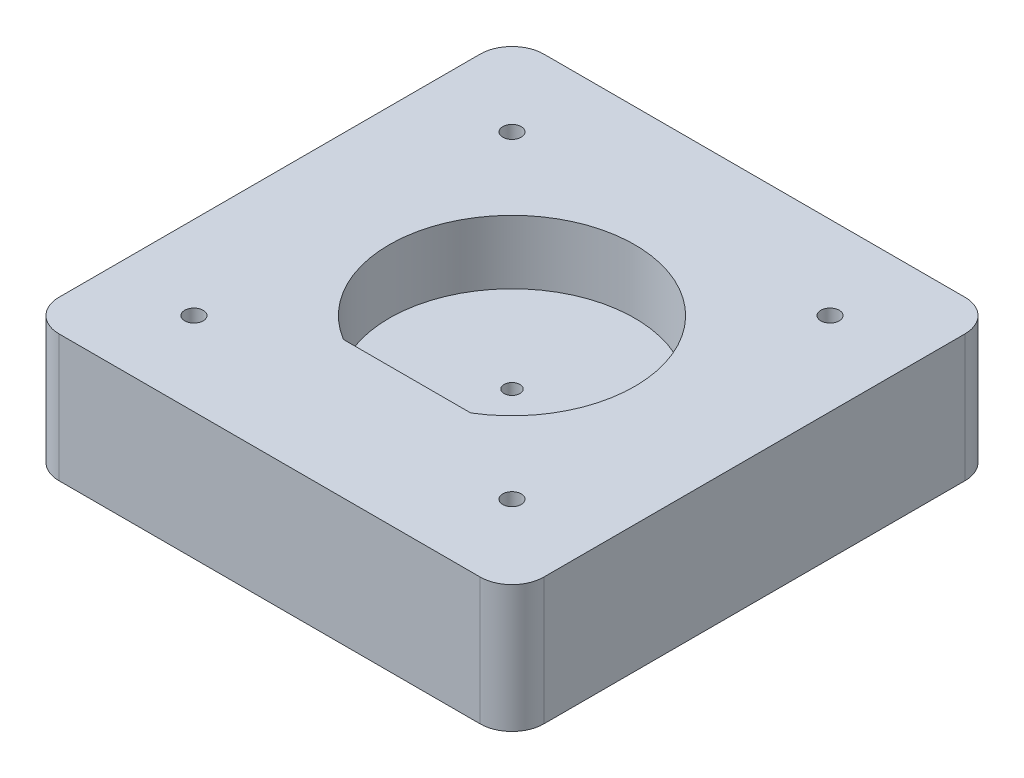
ISO-10303-21;
HEADER;
FILE_DESCRIPTION(('STEP AP214'),'2;1');
FILE_NAME('part.step','',(''),(''),'','','');
FILE_SCHEMA(('AUTOMOTIVE_DESIGN { 1 0 10303 214 1 1 1 1 }'));
ENDSEC;
DATA;
#1=APPLICATION_CONTEXT('core data for automotive mechanical design processes');
#2=APPLICATION_PROTOCOL_DEFINITION('international standard','automotive_design',2000,#1);
#3=PRODUCT_CONTEXT('',#1,'mechanical');
#4=PRODUCT('Part','Part','',(#3));
#5=PRODUCT_RELATED_PRODUCT_CATEGORY('part','',(#4));
#6=PRODUCT_DEFINITION_FORMATION('','',#4);
#7=PRODUCT_DEFINITION_CONTEXT('part definition',#1,'design');
#8=PRODUCT_DEFINITION('design','',#6,#7);
#9=PRODUCT_DEFINITION_SHAPE('','',#8);
#10=(LENGTH_UNIT() NAMED_UNIT(*) SI_UNIT(.MILLI.,.METRE.));
#11=(NAMED_UNIT(*) PLANE_ANGLE_UNIT() SI_UNIT($,.RADIAN.));
#12=(NAMED_UNIT(*) SI_UNIT($,.STERADIAN.) SOLID_ANGLE_UNIT());
#13=UNCERTAINTY_MEASURE_WITH_UNIT(LENGTH_MEASURE(1.E-05),#10,'distance_accuracy_value','');
#14=(GEOMETRIC_REPRESENTATION_CONTEXT(3) GLOBAL_UNCERTAINTY_ASSIGNED_CONTEXT((#13)) GLOBAL_UNIT_ASSIGNED_CONTEXT((#10,
#11,#12)) REPRESENTATION_CONTEXT('',''));
#15=CARTESIAN_POINT('',(0.,0.,0.));
#16=DIRECTION('',(0.,0.,1.));
#17=DIRECTION('',(1.,0.,0.));
#18=AXIS2_PLACEMENT_3D('',#15,#16,#17);
#19=CARTESIAN_POINT('',(38.1,20.,38.1));
#20=DIRECTION('',(-1.,0.,0.));
#21=DIRECTION('',(0.,0.,1.));
#22=AXIS2_PLACEMENT_3D('',#19,#20,#21);
#23=PLANE('',#22);
#24=DIRECTION('',(0.,0.,-1.));
#25=VECTOR('',#24,1.);
#26=CARTESIAN_POINT('',(38.1,0.,38.1));
#27=LINE('',#26,#25);
#28=CARTESIAN_POINT('',(38.1,0.,33.1));
#29=VERTEX_POINT('',#28);
#30=CARTESIAN_POINT('',(38.1,0.,-33.1));
#31=VERTEX_POINT('',#30);
#32=EDGE_CURVE('E139',#29,#31,#27,.T.);
#33=ORIENTED_EDGE('',*,*,#32,.T.);
#34=DIRECTION('',(0.,-1.,0.));
#35=VECTOR('',#34,1.);
#36=CARTESIAN_POINT('',(38.1,20.,-33.1));
#37=LINE('',#36,#35);
#38=CARTESIAN_POINT('',(38.1,20.,-33.1));
#39=VERTEX_POINT('',#38);
#40=EDGE_CURVE('E177',#31,#39,#37,.F.);
#41=ORIENTED_EDGE('',*,*,#40,.T.);
#42=DIRECTION('',(0.,0.,-1.));
#43=VECTOR('',#42,1.);
#44=CARTESIAN_POINT('',(38.1,20.,38.1));
#45=LINE('',#44,#43);
#46=CARTESIAN_POINT('',(38.1,20.,33.1));
#47=VERTEX_POINT('',#46);
#48=EDGE_CURVE('E141',#47,#39,#45,.T.);
#49=ORIENTED_EDGE('',*,*,#48,.F.);
#50=DIRECTION('',(0.,-1.,0.));
#51=VECTOR('',#50,1.);
#52=CARTESIAN_POINT('',(38.1,20.,33.1));
#53=LINE('',#52,#51);
#54=EDGE_CURVE('E174',#47,#29,#53,.T.);
#55=ORIENTED_EDGE('',*,*,#54,.T.);
#56=EDGE_LOOP('',(#33,#41,#49,#55));
#57=FACE_BOUND('',#56,.T.);
#58=ADVANCED_FACE('F36',(#57),#23,.F.);
#59=CARTESIAN_POINT('',(-38.1,20.,-38.1));
#60=DIRECTION('',(0.,0.,1.));
#61=DIRECTION('',(1.,0.,0.));
#62=AXIS2_PLACEMENT_3D('',#59,#60,#61);
#63=PLANE('',#62);
#64=DIRECTION('',(-1.,0.,0.));
#65=VECTOR('',#64,1.);
#66=CARTESIAN_POINT('',(-38.1,20.,-38.1));
#67=LINE('',#66,#65);
#68=CARTESIAN_POINT('',(33.1,20.,-38.1));
#69=VERTEX_POINT('',#68);
#70=CARTESIAN_POINT('',(-33.1,20.,-38.1));
#71=VERTEX_POINT('',#70);
#72=EDGE_CURVE('E144',#69,#71,#67,.T.);
#73=ORIENTED_EDGE('',*,*,#72,.F.);
#74=DIRECTION('',(0.,-1.,0.));
#75=VECTOR('',#74,1.);
#76=CARTESIAN_POINT('',(33.1,20.,-38.1));
#77=LINE('',#76,#75);
#78=CARTESIAN_POINT('',(33.1,0.,-38.1));
#79=VERTEX_POINT('',#78);
#80=EDGE_CURVE('E163',#69,#79,#77,.T.);
#81=ORIENTED_EDGE('',*,*,#80,.T.);
#82=DIRECTION('',(-1.,0.,0.));
#83=VECTOR('',#82,1.);
#84=CARTESIAN_POINT('',(-38.1,0.,-38.1));
#85=LINE('',#84,#83);
#86=CARTESIAN_POINT('',(-33.1,0.,-38.1));
#87=VERTEX_POINT('',#86);
#88=EDGE_CURVE('E155',#79,#87,#85,.T.);
#89=ORIENTED_EDGE('',*,*,#88,.T.);
#90=DIRECTION('',(0.,-1.,0.));
#91=VECTOR('',#90,1.);
#92=CARTESIAN_POINT('',(-33.1,20.,-38.1));
#93=LINE('',#92,#91);
#94=EDGE_CURVE('E152',#87,#71,#93,.F.);
#95=ORIENTED_EDGE('',*,*,#94,.T.);
#96=EDGE_LOOP('',(#73,#81,#89,#95));
#97=FACE_BOUND('',#96,.T.);
#98=ADVANCED_FACE('F220',(#97),#63,.F.);
#99=CARTESIAN_POINT('',(-38.1,20.,38.1));
#100=DIRECTION('',(1.,0.,0.));
#101=DIRECTION('',(0.,0.,-1.));
#102=AXIS2_PLACEMENT_3D('',#99,#100,#101);
#103=PLANE('',#102);
#104=DIRECTION('',(0.,0.,1.));
#105=VECTOR('',#104,1.);
#106=CARTESIAN_POINT('',(-38.1,20.,38.1));
#107=LINE('',#106,#105);
#108=CARTESIAN_POINT('',(-38.1,20.,-33.1));
#109=VERTEX_POINT('',#108);
#110=CARTESIAN_POINT('',(-38.1,20.,33.1));
#111=VERTEX_POINT('',#110);
#112=EDGE_CURVE('E148',#109,#111,#107,.T.);
#113=ORIENTED_EDGE('',*,*,#112,.F.);
#114=DIRECTION('',(0.,-1.,0.));
#115=VECTOR('',#114,1.);
#116=CARTESIAN_POINT('',(-38.1,20.,-33.1));
#117=LINE('',#116,#115);
#118=CARTESIAN_POINT('',(-38.1,0.,-33.1));
#119=VERTEX_POINT('',#118);
#120=EDGE_CURVE('E188',#109,#119,#117,.T.);
#121=ORIENTED_EDGE('',*,*,#120,.T.);
#122=DIRECTION('',(0.,0.,1.));
#123=VECTOR('',#122,1.);
#124=CARTESIAN_POINT('',(-38.1,0.,38.1));
#125=LINE('',#124,#123);
#126=CARTESIAN_POINT('',(-38.1,0.,33.1));
#127=VERTEX_POINT('',#126);
#128=EDGE_CURVE('E158',#119,#127,#125,.T.);
#129=ORIENTED_EDGE('',*,*,#128,.T.);
#130=DIRECTION('',(0.,-1.,0.));
#131=VECTOR('',#130,1.);
#132=CARTESIAN_POINT('',(-38.1,20.,33.1));
#133=LINE('',#132,#131);
#134=EDGE_CURVE('E186',#127,#111,#133,.F.);
#135=ORIENTED_EDGE('',*,*,#134,.T.);
#136=EDGE_LOOP('',(#113,#121,#129,#135));
#137=FACE_BOUND('',#136,.T.);
#138=ADVANCED_FACE('F194',(#137),#103,.F.);
#139=CARTESIAN_POINT('',(-38.1,20.,38.1));
#140=DIRECTION('',(0.,0.,-1.));
#141=DIRECTION('',(-1.,0.,0.));
#142=AXIS2_PLACEMENT_3D('',#139,#140,#141);
#143=PLANE('',#142);
#144=DIRECTION('',(1.,0.,0.));
#145=VECTOR('',#144,1.);
#146=CARTESIAN_POINT('',(-38.1,20.,38.1));
#147=LINE('',#146,#145);
#148=CARTESIAN_POINT('',(-33.1,20.,38.1));
#149=VERTEX_POINT('',#148);
#150=CARTESIAN_POINT('',(33.1,20.,38.1));
#151=VERTEX_POINT('',#150);
#152=EDGE_CURVE('E150',#149,#151,#147,.T.);
#153=ORIENTED_EDGE('',*,*,#152,.F.);
#154=DIRECTION('',(0.,-1.,0.));
#155=VECTOR('',#154,1.);
#156=CARTESIAN_POINT('',(-33.1,20.,38.1));
#157=LINE('',#156,#155);
#158=CARTESIAN_POINT('',(-33.1,0.,38.1));
#159=VERTEX_POINT('',#158);
#160=EDGE_CURVE('E11',#149,#159,#157,.T.);
#161=ORIENTED_EDGE('',*,*,#160,.T.);
#162=DIRECTION('',(1.,0.,0.));
#163=VECTOR('',#162,1.);
#164=CARTESIAN_POINT('',(-38.1,0.,38.1));
#165=LINE('',#164,#163);
#166=CARTESIAN_POINT('',(33.1,0.,38.1));
#167=VERTEX_POINT('',#166);
#168=EDGE_CURVE('E145',#159,#167,#165,.T.);
#169=ORIENTED_EDGE('',*,*,#168,.T.);
#170=DIRECTION('',(0.,-1.,0.));
#171=VECTOR('',#170,1.);
#172=CARTESIAN_POINT('',(33.1,20.,38.1));
#173=LINE('',#172,#171);
#174=EDGE_CURVE('E44',#167,#151,#173,.F.);
#175=ORIENTED_EDGE('',*,*,#174,.T.);
#176=EDGE_LOOP('',(#153,#161,#169,#175));
#177=FACE_BOUND('',#176,.T.);
#178=ADVANCED_FACE('F205',(#177),#143,.F.);
#179=CARTESIAN_POINT('',(0.,20.,0.));
#180=DIRECTION('',(0.,-1.,0.));
#181=DIRECTION('',(0.,0.,-1.));
#182=AXIS2_PLACEMENT_3D('',#179,#180,#181);
#183=PLANE('',#182);
#184=CARTESIAN_POINT('',(-25.,20.,-25.));
#185=DIRECTION('',(0.,-1.,0.));
#186=DIRECTION('',(0.,0.,-1.));
#187=AXIS2_PLACEMENT_3D('',#184,#185,#186);
#188=CIRCLE('',#187,1.45);
#189=CARTESIAN_POINT('',(-25.,20.,-26.45));
#190=VERTEX_POINT('',#189);
#191=EDGE_CURVE('E286',#190,#190,#188,.T.);
#192=ORIENTED_EDGE('',*,*,#191,.T.);
#193=EDGE_LOOP('',(#192));
#194=FACE_BOUND('',#193,.T.);
#195=CARTESIAN_POINT('',(25.,20.,25.));
#196=DIRECTION('',(0.,-1.,0.));
#197=DIRECTION('',(0.,0.,-1.));
#198=AXIS2_PLACEMENT_3D('',#195,#196,#197);
#199=CIRCLE('',#198,1.45);
#200=CARTESIAN_POINT('',(25.,20.,23.55));
#201=VERTEX_POINT('',#200);
#202=EDGE_CURVE('E296',#201,#201,#199,.T.);
#203=ORIENTED_EDGE('',*,*,#202,.T.);
#204=EDGE_LOOP('',(#203));
#205=FACE_BOUND('',#204,.T.);
#206=CARTESIAN_POINT('',(25.,20.,-25.));
#207=DIRECTION('',(0.,-1.,0.));
#208=DIRECTION('',(0.,0.,-1.));
#209=AXIS2_PLACEMENT_3D('',#206,#207,#208);
#210=CIRCLE('',#209,1.45);
#211=CARTESIAN_POINT('',(25.,20.,-26.45));
#212=VERTEX_POINT('',#211);
#213=EDGE_CURVE('E302',#212,#212,#210,.T.);
#214=ORIENTED_EDGE('',*,*,#213,.T.);
#215=EDGE_LOOP('',(#214));
#216=FACE_BOUND('',#215,.T.);
#217=CARTESIAN_POINT('',(-25.,20.,25.));
#218=DIRECTION('',(0.,-1.,0.));
#219=DIRECTION('',(0.,0.,-1.));
#220=AXIS2_PLACEMENT_3D('',#217,#218,#219);
#221=CIRCLE('',#220,1.45);
#222=CARTESIAN_POINT('',(-25.,20.,23.55));
#223=VERTEX_POINT('',#222);
#224=EDGE_CURVE('E308',#223,#223,#221,.T.);
#225=ORIENTED_EDGE('',*,*,#224,.T.);
#226=EDGE_LOOP('',(#225));
#227=FACE_BOUND('',#226,.T.);
#228=DIRECTION('',(1.,0.,0.));
#229=VECTOR('',#228,1.);
#230=CARTESIAN_POINT('',(-10.,20.,16.5072711251739));
#231=LINE('',#230,#229);
#232=CARTESIAN_POINT('',(-10.,20.,16.5072711251739));
#233=VERTEX_POINT('',#232);
#234=CARTESIAN_POINT('',(10.,20.,16.5072711251739));
#235=VERTEX_POINT('',#234);
#236=EDGE_CURVE('E130',#233,#235,#231,.T.);
#237=ORIENTED_EDGE('',*,*,#236,.F.);
#238=CARTESIAN_POINT('',(0.,20.,0.));
#239=DIRECTION('',(0.,1.,0.));
#240=DIRECTION('',(0.,0.,1.));
#241=AXIS2_PLACEMENT_3D('',#238,#239,#240);
#242=CIRCLE('',#241,19.3);
#243=EDGE_CURVE('E120',#235,#233,#242,.T.);
#244=ORIENTED_EDGE('',*,*,#243,.F.);
#245=EDGE_LOOP('',(#237,#244));
#246=FACE_BOUND('',#245,.T.);
#247=ORIENTED_EDGE('',*,*,#48,.T.);
#248=CARTESIAN_POINT('',(33.1,20.,-33.1));
#249=DIRECTION('',(0.,-1.,0.));
#250=DIRECTION('',(0.,0.,-1.));
#251=AXIS2_PLACEMENT_3D('',#248,#249,#250);
#252=CIRCLE('',#251,5.);
#253=EDGE_CURVE('E184',#39,#69,#252,.F.);
#254=ORIENTED_EDGE('',*,*,#253,.T.);
#255=ORIENTED_EDGE('',*,*,#72,.T.);
#256=CARTESIAN_POINT('',(-33.1,20.,-33.1));
#257=DIRECTION('',(0.,-1.,0.));
#258=DIRECTION('',(0.,0.,-1.));
#259=AXIS2_PLACEMENT_3D('',#256,#257,#258);
#260=CIRCLE('',#259,5.);
#261=EDGE_CURVE('E182',#71,#109,#260,.F.);
#262=ORIENTED_EDGE('',*,*,#261,.T.);
#263=ORIENTED_EDGE('',*,*,#112,.T.);
#264=CARTESIAN_POINT('',(-33.1,20.,33.1));
#265=DIRECTION('',(0.,-1.,0.));
#266=DIRECTION('',(0.,0.,-1.));
#267=AXIS2_PLACEMENT_3D('',#264,#265,#266);
#268=CIRCLE('',#267,5.);
#269=EDGE_CURVE('E57',#111,#149,#268,.F.);
#270=ORIENTED_EDGE('',*,*,#269,.T.);
#271=ORIENTED_EDGE('',*,*,#152,.T.);
#272=CARTESIAN_POINT('',(33.1,20.,33.1));
#273=DIRECTION('',(0.,-1.,0.));
#274=DIRECTION('',(0.,0.,-1.));
#275=AXIS2_PLACEMENT_3D('',#272,#273,#274);
#276=CIRCLE('',#275,5.);
#277=EDGE_CURVE('E179',#151,#47,#276,.F.);
#278=ORIENTED_EDGE('',*,*,#277,.T.);
#279=EDGE_LOOP('',(#247,#254,#255,#262,#263,#270,#271,#278));
#280=FACE_BOUND('',#279,.T.);
#281=ADVANCED_FACE('F207',(#194,#205,#216,#227,#246,#280),#183,.F.);
#282=CARTESIAN_POINT('',(0.,0.,0.));
#283=DIRECTION('',(0.,-1.,0.));
#284=DIRECTION('',(0.,0.,-1.));
#285=AXIS2_PLACEMENT_3D('',#282,#283,#284);
#286=PLANE('',#285);
#287=CARTESIAN_POINT('',(-25.,0.,-25.));
#288=DIRECTION('',(0.,-1.,0.));
#289=DIRECTION('',(0.,0.,-1.));
#290=AXIS2_PLACEMENT_3D('',#287,#288,#289);
#291=CIRCLE('',#290,1.45);
#292=CARTESIAN_POINT('',(-25.,0.,-26.45));
#293=VERTEX_POINT('',#292);
#294=EDGE_CURVE('E289',#293,#293,#291,.T.);
#295=ORIENTED_EDGE('',*,*,#294,.F.);
#296=EDGE_LOOP('',(#295));
#297=FACE_BOUND('',#296,.T.);
#298=CARTESIAN_POINT('',(25.,0.,25.));
#299=DIRECTION('',(0.,-1.,0.));
#300=DIRECTION('',(0.,0.,-1.));
#301=AXIS2_PLACEMENT_3D('',#298,#299,#300);
#302=CIRCLE('',#301,1.45);
#303=CARTESIAN_POINT('',(25.,0.,23.55));
#304=VERTEX_POINT('',#303);
#305=EDGE_CURVE('E291',#304,#304,#302,.T.);
#306=ORIENTED_EDGE('',*,*,#305,.F.);
#307=EDGE_LOOP('',(#306));
#308=FACE_BOUND('',#307,.T.);
#309=CARTESIAN_POINT('',(25.,0.,-25.));
#310=DIRECTION('',(0.,-1.,0.));
#311=DIRECTION('',(0.,0.,-1.));
#312=AXIS2_PLACEMENT_3D('',#309,#310,#311);
#313=CIRCLE('',#312,1.45);
#314=CARTESIAN_POINT('',(25.,0.,-26.45));
#315=VERTEX_POINT('',#314);
#316=EDGE_CURVE('E299',#315,#315,#313,.T.);
#317=ORIENTED_EDGE('',*,*,#316,.F.);
#318=EDGE_LOOP('',(#317));
#319=FACE_BOUND('',#318,.T.);
#320=CARTESIAN_POINT('',(-25.,0.,25.));
#321=DIRECTION('',(0.,-1.,0.));
#322=DIRECTION('',(0.,0.,-1.));
#323=AXIS2_PLACEMENT_3D('',#320,#321,#322);
#324=CIRCLE('',#323,1.45);
#325=CARTESIAN_POINT('',(-25.,0.,23.55));
#326=VERTEX_POINT('',#325);
#327=EDGE_CURVE('E305',#326,#326,#324,.T.);
#328=ORIENTED_EDGE('',*,*,#327,.F.);
#329=EDGE_LOOP('',(#328));
#330=FACE_BOUND('',#329,.T.);
#331=CARTESIAN_POINT('',(0.,0.,0.));
#332=DIRECTION('',(0.,-1.,0.));
#333=DIRECTION('',(0.,0.,-1.));
#334=AXIS2_PLACEMENT_3D('',#331,#332,#333);
#335=CIRCLE('',#334,10.);
#336=CARTESIAN_POINT('',(0.,0.,-10.));
#337=VERTEX_POINT('',#336);
#338=EDGE_CURVE('E317',#337,#337,#335,.T.);
#339=ORIENTED_EDGE('',*,*,#338,.F.);
#340=EDGE_LOOP('',(#339));
#341=FACE_BOUND('',#340,.T.);
#342=ORIENTED_EDGE('',*,*,#88,.F.);
#343=CARTESIAN_POINT('',(33.1,0.,-33.1));
#344=DIRECTION('',(0.,-1.,0.));
#345=DIRECTION('',(0.,0.,-1.));
#346=AXIS2_PLACEMENT_3D('',#343,#344,#345);
#347=CIRCLE('',#346,5.);
#348=EDGE_CURVE('E172',#79,#31,#347,.T.);
#349=ORIENTED_EDGE('',*,*,#348,.T.);
#350=ORIENTED_EDGE('',*,*,#32,.F.);
#351=CARTESIAN_POINT('',(33.1,0.,33.1));
#352=DIRECTION('',(0.,-1.,0.));
#353=DIRECTION('',(0.,0.,-1.));
#354=AXIS2_PLACEMENT_3D('',#351,#352,#353);
#355=CIRCLE('',#354,5.);
#356=EDGE_CURVE('E166',#29,#167,#355,.T.);
#357=ORIENTED_EDGE('',*,*,#356,.T.);
#358=ORIENTED_EDGE('',*,*,#168,.F.);
#359=CARTESIAN_POINT('',(-33.1,0.,33.1));
#360=DIRECTION('',(0.,-1.,0.));
#361=DIRECTION('',(0.,0.,-1.));
#362=AXIS2_PLACEMENT_3D('',#359,#360,#361);
#363=CIRCLE('',#362,5.);
#364=EDGE_CURVE('E168',#159,#127,#363,.T.);
#365=ORIENTED_EDGE('',*,*,#364,.T.);
#366=ORIENTED_EDGE('',*,*,#128,.F.);
#367=CARTESIAN_POINT('',(-33.1,0.,-33.1));
#368=DIRECTION('',(0.,-1.,0.));
#369=DIRECTION('',(0.,0.,-1.));
#370=AXIS2_PLACEMENT_3D('',#367,#368,#369);
#371=CIRCLE('',#370,5.);
#372=EDGE_CURVE('E170',#119,#87,#371,.T.);
#373=ORIENTED_EDGE('',*,*,#372,.T.);
#374=EDGE_LOOP('',(#342,#349,#350,#357,#358,#365,#366,#373));
#375=FACE_BOUND('',#374,.T.);
#376=ADVANCED_FACE('F200',(#297,#308,#319,#330,#341,#375),#286,.T.);
#377=CARTESIAN_POINT('',(0.,10.,0.));
#378=DIRECTION('',(0.,1.,0.));
#379=DIRECTION('',(0.,0.,1.));
#380=AXIS2_PLACEMENT_3D('',#377,#378,#379);
#381=CYLINDRICAL_SURFACE('',#380,19.3);
#382=ORIENTED_EDGE('',*,*,#243,.T.);
#383=DIRECTION('',(0.,1.,0.));
#384=VECTOR('',#383,1.);
#385=CARTESIAN_POINT('',(-10.,10.,16.5072711251739));
#386=LINE('',#385,#384);
#387=CARTESIAN_POINT('',(-10.,10.,16.5072711251739));
#388=VERTEX_POINT('',#387);
#389=EDGE_CURVE('E114',#388,#233,#386,.T.);
#390=ORIENTED_EDGE('',*,*,#389,.F.);
#391=CARTESIAN_POINT('',(0.,10.,0.));
#392=DIRECTION('',(0.,1.,0.));
#393=DIRECTION('',(0.,0.,1.));
#394=AXIS2_PLACEMENT_3D('',#391,#392,#393);
#395=CIRCLE('',#394,19.3);
#396=CARTESIAN_POINT('',(10.,10.,16.5072711251739));
#397=VERTEX_POINT('',#396);
#398=EDGE_CURVE('E117',#397,#388,#395,.T.);
#399=ORIENTED_EDGE('',*,*,#398,.F.);
#400=DIRECTION('',(0.,1.,0.));
#401=VECTOR('',#400,1.);
#402=CARTESIAN_POINT('',(10.,10.,16.5072711251739));
#403=LINE('',#402,#401);
#404=EDGE_CURVE('E125',#397,#235,#403,.T.);
#405=ORIENTED_EDGE('',*,*,#404,.T.);
#406=EDGE_LOOP('',(#382,#390,#399,#405));
#407=FACE_BOUND('',#406,.T.);
#408=ADVANCED_FACE('F116',(#407),#381,.F.);
#409=CARTESIAN_POINT('',(-10.,10.,16.5072711251739));
#410=DIRECTION('',(0.,0.,1.));
#411=DIRECTION('',(1.,0.,0.));
#412=AXIS2_PLACEMENT_3D('',#409,#410,#411);
#413=PLANE('',#412);
#414=ORIENTED_EDGE('',*,*,#236,.T.);
#415=ORIENTED_EDGE('',*,*,#404,.F.);
#416=DIRECTION('',(1.,0.,0.));
#417=VECTOR('',#416,1.);
#418=CARTESIAN_POINT('',(-10.,10.,16.5072711251739));
#419=LINE('',#418,#417);
#420=EDGE_CURVE('E126',#388,#397,#419,.T.);
#421=ORIENTED_EDGE('',*,*,#420,.F.);
#422=ORIENTED_EDGE('',*,*,#389,.T.);
#423=EDGE_LOOP('',(#414,#415,#421,#422));
#424=FACE_BOUND('',#423,.T.);
#425=ADVANCED_FACE('F132',(#424),#413,.F.);
#426=CARTESIAN_POINT('',(0.,10.,0.));
#427=DIRECTION('',(0.,1.,0.));
#428=DIRECTION('',(0.,0.,1.));
#429=AXIS2_PLACEMENT_3D('',#426,#427,#428);
#430=PLANE('',#429);
#431=CARTESIAN_POINT('',(0.,10.,0.));
#432=DIRECTION('',(0.,1.,0.));
#433=DIRECTION('',(0.,0.,1.));
#434=AXIS2_PLACEMENT_3D('',#431,#432,#433);
#435=CIRCLE('',#434,1.24999999999999);
#436=CARTESIAN_POINT('',(0.,10.,1.24999999999999));
#437=VERTEX_POINT('',#436);
#438=EDGE_CURVE('E314',#437,#437,#435,.T.);
#439=ORIENTED_EDGE('',*,*,#438,.F.);
#440=EDGE_LOOP('',(#439));
#441=FACE_BOUND('',#440,.T.);
#442=ORIENTED_EDGE('',*,*,#398,.T.);
#443=ORIENTED_EDGE('',*,*,#420,.T.);
#444=EDGE_LOOP('',(#442,#443));
#445=FACE_BOUND('',#444,.T.);
#446=ADVANCED_FACE('F129',(#441,#445),#430,.T.);
#447=CARTESIAN_POINT('',(0.,5.,0.));
#448=DIRECTION('',(0.,-1.,0.));
#449=DIRECTION('',(0.,0.,-1.));
#450=AXIS2_PLACEMENT_3D('',#447,#448,#449);
#451=CYLINDRICAL_SURFACE('',#450,10.);
#452=CARTESIAN_POINT('',(0.,5.,0.));
#453=DIRECTION('',(0.,-1.,0.));
#454=DIRECTION('',(0.,0.,-1.));
#455=AXIS2_PLACEMENT_3D('',#452,#453,#454);
#456=CIRCLE('',#455,10.);
#457=CARTESIAN_POINT('',(0.,5.,-10.));
#458=VERTEX_POINT('',#457);
#459=EDGE_CURVE('E137',#458,#458,#456,.T.);
#460=ORIENTED_EDGE('',*,*,#459,.F.);
#461=EDGE_LOOP('',(#460));
#462=FACE_BOUND('',#461,.T.);
#463=ORIENTED_EDGE('',*,*,#338,.T.);
#464=EDGE_LOOP('',(#463));
#465=FACE_BOUND('',#464,.T.);
#466=ADVANCED_FACE('F254',(#462,#465),#451,.F.);
#467=CARTESIAN_POINT('',(0.,5.,0.));
#468=DIRECTION('',(0.,-1.,0.));
#469=DIRECTION('',(0.,0.,-1.));
#470=AXIS2_PLACEMENT_3D('',#467,#468,#469);
#471=PLANE('',#470);
#472=CARTESIAN_POINT('',(0.,5.,0.));
#473=DIRECTION('',(0.,-1.,0.));
#474=DIRECTION('',(0.,0.,-1.));
#475=AXIS2_PLACEMENT_3D('',#472,#473,#474);
#476=CIRCLE('',#475,1.24999999999999);
#477=CARTESIAN_POINT('',(0.,5.,-1.24999999999999));
#478=VERTEX_POINT('',#477);
#479=EDGE_CURVE('E311',#478,#478,#476,.T.);
#480=ORIENTED_EDGE('',*,*,#479,.F.);
#481=EDGE_LOOP('',(#480));
#482=FACE_BOUND('',#481,.T.);
#483=ORIENTED_EDGE('',*,*,#459,.T.);
#484=EDGE_LOOP('',(#483));
#485=FACE_BOUND('',#484,.T.);
#486=ADVANCED_FACE('F258',(#482,#485),#471,.T.);
#487=CARTESIAN_POINT('',(0.,5.,0.));
#488=DIRECTION('',(0.,-1.,0.));
#489=DIRECTION('',(0.,0.,-1.));
#490=AXIS2_PLACEMENT_3D('',#487,#488,#489);
#491=CYLINDRICAL_SURFACE('',#490,1.24999999999999);
#492=ORIENTED_EDGE('',*,*,#438,.T.);
#493=EDGE_LOOP('',(#492));
#494=FACE_BOUND('',#493,.T.);
#495=ORIENTED_EDGE('',*,*,#479,.T.);
#496=EDGE_LOOP('',(#495));
#497=FACE_BOUND('',#496,.T.);
#498=ADVANCED_FACE('F229',(#494,#497),#491,.F.);
#499=CARTESIAN_POINT('',(33.1,20.,-33.1));
#500=DIRECTION('',(0.,-1.,0.));
#501=DIRECTION('',(0.,0.,-1.));
#502=AXIS2_PLACEMENT_3D('',#499,#500,#501);
#503=CYLINDRICAL_SURFACE('',#502,5.);
#504=ORIENTED_EDGE('',*,*,#253,.F.);
#505=ORIENTED_EDGE('',*,*,#40,.F.);
#506=ORIENTED_EDGE('',*,*,#348,.F.);
#507=ORIENTED_EDGE('',*,*,#80,.F.);
#508=EDGE_LOOP('',(#504,#505,#506,#507));
#509=FACE_BOUND('',#508,.T.);
#510=ADVANCED_FACE('F217',(#509),#503,.T.);
#511=CARTESIAN_POINT('',(-33.1,20.,-33.1));
#512=DIRECTION('',(0.,-1.,0.));
#513=DIRECTION('',(0.,0.,-1.));
#514=AXIS2_PLACEMENT_3D('',#511,#512,#513);
#515=CYLINDRICAL_SURFACE('',#514,5.);
#516=ORIENTED_EDGE('',*,*,#261,.F.);
#517=ORIENTED_EDGE('',*,*,#94,.F.);
#518=ORIENTED_EDGE('',*,*,#372,.F.);
#519=ORIENTED_EDGE('',*,*,#120,.F.);
#520=EDGE_LOOP('',(#516,#517,#518,#519));
#521=FACE_BOUND('',#520,.T.);
#522=ADVANCED_FACE('F222',(#521),#515,.T.);
#523=CARTESIAN_POINT('',(-33.1,20.,33.1));
#524=DIRECTION('',(0.,-1.,0.));
#525=DIRECTION('',(0.,0.,-1.));
#526=AXIS2_PLACEMENT_3D('',#523,#524,#525);
#527=CYLINDRICAL_SURFACE('',#526,5.);
#528=ORIENTED_EDGE('',*,*,#269,.F.);
#529=ORIENTED_EDGE('',*,*,#134,.F.);
#530=ORIENTED_EDGE('',*,*,#364,.F.);
#531=ORIENTED_EDGE('',*,*,#160,.F.);
#532=EDGE_LOOP('',(#528,#529,#530,#531));
#533=FACE_BOUND('',#532,.T.);
#534=ADVANCED_FACE('F204',(#533),#527,.T.);
#535=CARTESIAN_POINT('',(33.1,20.,33.1));
#536=DIRECTION('',(0.,-1.,0.));
#537=DIRECTION('',(0.,0.,-1.));
#538=AXIS2_PLACEMENT_3D('',#535,#536,#537);
#539=CYLINDRICAL_SURFACE('',#538,5.);
#540=ORIENTED_EDGE('',*,*,#277,.F.);
#541=ORIENTED_EDGE('',*,*,#174,.F.);
#542=ORIENTED_EDGE('',*,*,#356,.F.);
#543=ORIENTED_EDGE('',*,*,#54,.F.);
#544=EDGE_LOOP('',(#540,#541,#542,#543));
#545=FACE_BOUND('',#544,.T.);
#546=ADVANCED_FACE('F38',(#545),#539,.T.);
#547=CARTESIAN_POINT('',(-25.,0.,25.));
#548=DIRECTION('',(0.,-1.,0.));
#549=DIRECTION('',(0.,0.,-1.));
#550=AXIS2_PLACEMENT_3D('',#547,#548,#549);
#551=CYLINDRICAL_SURFACE('',#550,1.45);
#552=ORIENTED_EDGE('',*,*,#224,.F.);
#553=EDGE_LOOP('',(#552));
#554=FACE_BOUND('',#553,.T.);
#555=ORIENTED_EDGE('',*,*,#327,.T.);
#556=EDGE_LOOP('',(#555));
#557=FACE_BOUND('',#556,.T.);
#558=ADVANCED_FACE('F266',(#554,#557),#551,.F.);
#559=CARTESIAN_POINT('',(25.,0.,-25.));
#560=DIRECTION('',(0.,-1.,0.));
#561=DIRECTION('',(0.,0.,-1.));
#562=AXIS2_PLACEMENT_3D('',#559,#560,#561);
#563=CYLINDRICAL_SURFACE('',#562,1.45);
#564=ORIENTED_EDGE('',*,*,#213,.F.);
#565=EDGE_LOOP('',(#564));
#566=FACE_BOUND('',#565,.T.);
#567=ORIENTED_EDGE('',*,*,#316,.T.);
#568=EDGE_LOOP('',(#567));
#569=FACE_BOUND('',#568,.T.);
#570=ADVANCED_FACE('F269',(#566,#569),#563,.F.);
#571=CARTESIAN_POINT('',(25.,0.,25.));
#572=DIRECTION('',(0.,-1.,0.));
#573=DIRECTION('',(0.,0.,-1.));
#574=AXIS2_PLACEMENT_3D('',#571,#572,#573);
#575=CYLINDRICAL_SURFACE('',#574,1.45);
#576=ORIENTED_EDGE('',*,*,#202,.F.);
#577=EDGE_LOOP('',(#576));
#578=FACE_BOUND('',#577,.T.);
#579=ORIENTED_EDGE('',*,*,#305,.T.);
#580=EDGE_LOOP('',(#579));
#581=FACE_BOUND('',#580,.T.);
#582=ADVANCED_FACE('F273',(#578,#581),#575,.F.);
#583=CARTESIAN_POINT('',(-25.,0.,-25.));
#584=DIRECTION('',(0.,-1.,0.));
#585=DIRECTION('',(0.,0.,-1.));
#586=AXIS2_PLACEMENT_3D('',#583,#584,#585);
#587=CYLINDRICAL_SURFACE('',#586,1.45);
#588=ORIENTED_EDGE('',*,*,#191,.F.);
#589=EDGE_LOOP('',(#588));
#590=FACE_BOUND('',#589,.T.);
#591=ORIENTED_EDGE('',*,*,#294,.T.);
#592=EDGE_LOOP('',(#591));
#593=FACE_BOUND('',#592,.T.);
#594=ADVANCED_FACE('F277',(#590,#593),#587,.F.);
#595=CLOSED_SHELL('',(#58,#98,#138,#178,#281,#376,#408,#425,#446,#466,#486,#498,#510,#522,#534,
#546,#558,#570,#582,#594));
#596=MANIFOLD_SOLID_BREP('B2',#595);
#597=ADVANCED_BREP_SHAPE_REPRESENTATION('',(#18,#596),#14);
#598=SHAPE_DEFINITION_REPRESENTATION(#9,#597);
ENDSEC;
END-ISO-10303-21;
